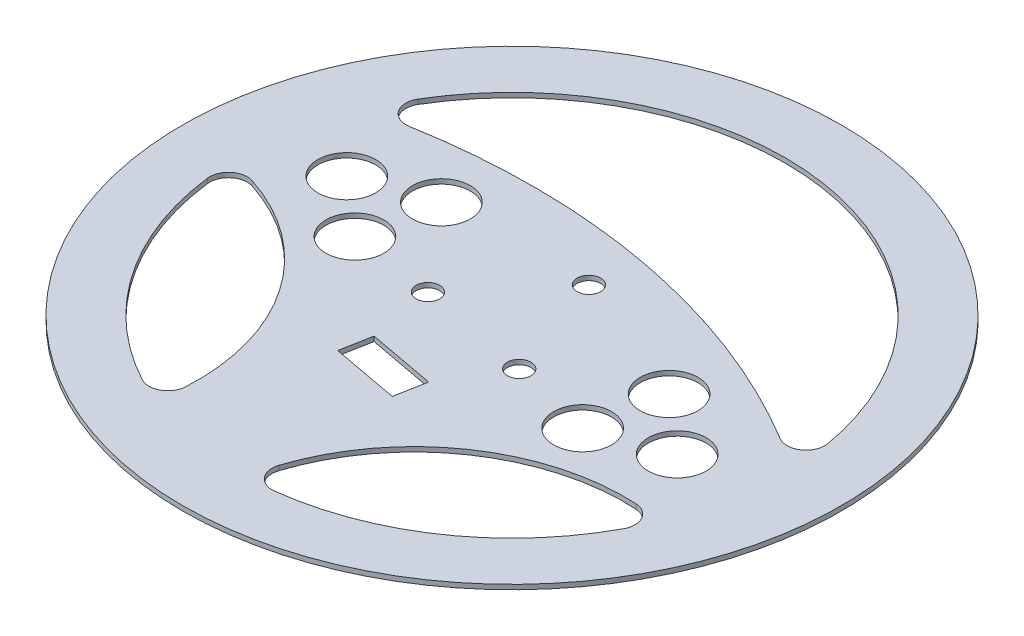
ISO-10303-21;
HEADER;
FILE_DESCRIPTION(('STEP AP214'),'2;1');
FILE_NAME('part.step','',(''),(''),'','','');
FILE_SCHEMA(('AUTOMOTIVE_DESIGN { 1 0 10303 214 1 1 1 1 }'));
ENDSEC;
DATA;
#1=APPLICATION_CONTEXT('core data for automotive mechanical design processes');
#2=APPLICATION_PROTOCOL_DEFINITION('international standard','automotive_design',2000,#1);
#3=PRODUCT_CONTEXT('',#1,'mechanical');
#4=PRODUCT('Part','Part','',(#3));
#5=PRODUCT_RELATED_PRODUCT_CATEGORY('part','',(#4));
#6=PRODUCT_DEFINITION_FORMATION('','',#4);
#7=PRODUCT_DEFINITION_CONTEXT('part definition',#1,'design');
#8=PRODUCT_DEFINITION('design','',#6,#7);
#9=PRODUCT_DEFINITION_SHAPE('','',#8);
#10=(LENGTH_UNIT() NAMED_UNIT(*) SI_UNIT(.MILLI.,.METRE.));
#11=(NAMED_UNIT(*) PLANE_ANGLE_UNIT() SI_UNIT($,.RADIAN.));
#12=(NAMED_UNIT(*) SI_UNIT($,.STERADIAN.) SOLID_ANGLE_UNIT());
#13=UNCERTAINTY_MEASURE_WITH_UNIT(LENGTH_MEASURE(1.E-05),#10,'distance_accuracy_value','');
#14=(GEOMETRIC_REPRESENTATION_CONTEXT(3) GLOBAL_UNCERTAINTY_ASSIGNED_CONTEXT((#13)) GLOBAL_UNIT_ASSIGNED_CONTEXT((#10,
#11,#12)) REPRESENTATION_CONTEXT('',''));
#15=CARTESIAN_POINT('',(0.,0.,0.));
#16=DIRECTION('',(0.,0.,1.));
#17=DIRECTION('',(1.,0.,0.));
#18=AXIS2_PLACEMENT_3D('',#15,#16,#17);
#19=CARTESIAN_POINT('',(0.,1.5875,-2.06711003662507));
#20=DIRECTION('',(0.,1.,0.));
#21=DIRECTION('',(0.,0.,1.));
#22=AXIS2_PLACEMENT_3D('',#19,#20,#21);
#23=PLANE('',#22);
#24=CARTESIAN_POINT('',(44.8976157062274,1.5875,19.0149701239264));
#25=DIRECTION('',(0.,1.,0.));
#26=DIRECTION('',(0.,0.,-1.));
#27=AXIS2_PLACEMENT_3D('',#24,#25,#26);
#28=CIRCLE('',#27,9.75);
#29=CARTESIAN_POINT('',(44.8976157062274,1.5875,9.2649701239264));
#30=VERTEX_POINT('',#29);
#31=EDGE_CURVE('E295',#30,#30,#28,.T.);
#32=ORIENTED_EDGE('',*,*,#31,.F.);
#33=EDGE_LOOP('',(#32));
#34=FACE_BOUND('',#33,.T.);
#35=CARTESIAN_POINT('',(16.8858438145613,1.5875,12.3834575532753));
#36=DIRECTION('',(0.,1.,0.));
#37=DIRECTION('',(0.,0.,1.));
#38=AXIS2_PLACEMENT_3D('',#35,#36,#37);
#39=CIRCLE('',#38,3.96875000000122);
#40=CARTESIAN_POINT('',(16.8858438145613,1.5875,16.3522075532765));
#41=VERTEX_POINT('',#40);
#42=EDGE_CURVE('E311',#41,#41,#39,.T.);
#43=ORIENTED_EDGE('',*,*,#42,.F.);
#44=EDGE_LOOP('',(#43));
#45=FACE_BOUND('',#44,.T.);
#46=CARTESIAN_POINT('',(-20.9574805392369,1.5875,5.33117587617061));
#47=DIRECTION('',(0.,1.,0.));
#48=DIRECTION('',(0.,0.,1.));
#49=AXIS2_PLACEMENT_3D('',#46,#47,#48);
#50=CIRCLE('',#49,3.9687500000018);
#51=CARTESIAN_POINT('',(-20.9574805392369,1.5875,9.29992587617241));
#52=VERTEX_POINT('',#51);
#53=EDGE_CURVE('E327',#52,#52,#50,.T.);
#54=ORIENTED_EDGE('',*,*,#53,.F.);
#55=EDGE_LOOP('',(#54));
#56=FACE_BOUND('',#55,.T.);
#57=CARTESIAN_POINT('',(-44.8976157062275,1.5875,-23.1491901971765));
#58=DIRECTION('',(0.,1.,0.));
#59=DIRECTION('',(0.,0.,1.));
#60=AXIS2_PLACEMENT_3D('',#57,#58,#59);
#61=CIRCLE('',#60,9.75);
#62=CARTESIAN_POINT('',(-44.8976157062275,1.5875,-13.3991901971765));
#63=VERTEX_POINT('',#62);
#64=EDGE_CURVE('E343',#63,#63,#61,.T.);
#65=ORIENTED_EDGE('',*,*,#64,.F.);
#66=EDGE_LOOP('',(#65));
#67=FACE_BOUND('',#66,.T.);
#68=DIRECTION('',(0.183200752516462,0.,-0.983075523180901));
#69=VECTOR('',#68,1.);
#70=CARTESIAN_POINT('',(3.51999002482874,1.5875,41.8169016517409));
#71=LINE('',#70,#69);
#72=CARTESIAN_POINT('',(3.51999002482874,1.5875,41.8169016517409));
#73=VERTEX_POINT('',#72);
#74=CARTESIAN_POINT('',(5.4435979262516,1.5875,31.4946086583415));
#75=VERTEX_POINT('',#74);
#76=EDGE_CURVE('E362',#73,#75,#71,.T.);
#77=ORIENTED_EDGE('',*,*,#76,.F.);
#78=DIRECTION('',(0.983075523180901,0.,0.183200752516463));
#79=VECTOR('',#78,1.);
#80=CARTESIAN_POINT('',(-19.090747008332,1.5875,37.6032843438623));
#81=LINE('',#80,#79);
#82=CARTESIAN_POINT('',(-19.090747008332,1.5875,37.6032843438623));
#83=VERTEX_POINT('',#82);
#84=EDGE_CURVE('E359',#83,#73,#81,.T.);
#85=ORIENTED_EDGE('',*,*,#84,.F.);
#86=DIRECTION('',(-0.183200752516463,0.,0.983075523180901));
#87=VECTOR('',#86,1.);
#88=CARTESIAN_POINT('',(-17.1671391069091,1.5875,27.2809913504628));
#89=LINE('',#88,#87);
#90=CARTESIAN_POINT('',(-17.1671391069091,1.5875,27.2809913504628));
#91=VERTEX_POINT('',#90);
#92=EDGE_CURVE('E370',#91,#83,#89,.T.);
#93=ORIENTED_EDGE('',*,*,#92,.F.);
#94=DIRECTION('',(-0.983075523180901,0.,-0.183200752516463));
#95=VECTOR('',#94,1.);
#96=CARTESIAN_POINT('',(5.4435979262516,1.5875,31.4946086583415));
#97=LINE('',#96,#95);
#98=EDGE_CURVE('E366',#75,#91,#97,.T.);
#99=ORIENTED_EDGE('',*,*,#98,.F.);
#100=EDGE_LOOP('',(#77,#85,#93,#99));
#101=FACE_BOUND('',#100,.T.);
#102=CARTESIAN_POINT('',(0.,1.5875,-2.06711003662507));
#103=DIRECTION('',(0.,1.,0.));
#104=DIRECTION('',(0.,0.,1.));
#105=AXIS2_PLACEMENT_3D('',#102,#103,#104);
#106=CIRCLE('',#105,111.125);
#107=CARTESIAN_POINT('',(0.,1.5875,109.057889963375));
#108=VERTEX_POINT('',#107);
#109=EDGE_CURVE('E11',#108,#108,#106,.T.);
#110=ORIENTED_EDGE('',*,*,#109,.T.);
#111=EDGE_LOOP('',(#110));
#112=FACE_BOUND('',#111,.T.);
#113=CARTESIAN_POINT('',(4.07163672467834,1.5875,-23.9159635393206));
#114=DIRECTION('',(0.,1.,0.));
#115=DIRECTION('',(0.,0.,1.));
#116=AXIS2_PLACEMENT_3D('',#113,#114,#115);
#117=CIRCLE('',#116,3.96875);
#118=CARTESIAN_POINT('',(4.07163672467834,1.5875,-19.9472135393206));
#119=VERTEX_POINT('',#118);
#120=EDGE_CURVE('E351',#119,#119,#117,.T.);
#121=ORIENTED_EDGE('',*,*,#120,.F.);
#122=EDGE_LOOP('',(#121));
#123=FACE_BOUND('',#122,.T.);
#124=CARTESIAN_POINT('',(-49.4776345191391,1.5875,1.42769788234599));
#125=DIRECTION('',(0.,1.,0.));
#126=DIRECTION('',(0.,0.,1.));
#127=AXIS2_PLACEMENT_3D('',#124,#125,#126);
#128=CIRCLE('',#127,9.75);
#129=CARTESIAN_POINT('',(-49.4776345191391,1.5875,11.177697882346));
#130=VERTEX_POINT('',#129);
#131=EDGE_CURVE('E335',#130,#130,#128,.T.);
#132=ORIENTED_EDGE('',*,*,#131,.F.);
#133=EDGE_LOOP('',(#132));
#134=FACE_BOUND('',#133,.T.);
#135=CARTESIAN_POINT('',(-68.4718345355167,1.5875,-14.8271587992073));
#136=DIRECTION('',(0.,1.,0.));
#137=DIRECTION('',(0.,0.,1.));
#138=AXIS2_PLACEMENT_3D('',#135,#136,#137);
#139=CIRCLE('',#138,9.75);
#140=CARTESIAN_POINT('',(-68.4718345355167,1.5875,-5.07715879920734));
#141=VERTEX_POINT('',#140);
#142=EDGE_CURVE('E319',#141,#141,#139,.T.);
#143=ORIENTED_EDGE('',*,*,#142,.F.);
#144=EDGE_LOOP('',(#143));
#145=FACE_BOUND('',#144,.T.);
#146=CARTESIAN_POINT('',(68.4718345355166,1.5875,10.6929387259572));
#147=DIRECTION('',(0.,1.,0.));
#148=DIRECTION('',(0.,0.,-1.));
#149=AXIS2_PLACEMENT_3D('',#146,#147,#148);
#150=CIRCLE('',#149,9.75);
#151=CARTESIAN_POINT('',(68.4718345355166,1.5875,0.942938725957191));
#152=VERTEX_POINT('',#151);
#153=EDGE_CURVE('E303',#152,#152,#150,.T.);
#154=ORIENTED_EDGE('',*,*,#153,.F.);
#155=EDGE_LOOP('',(#154));
#156=FACE_BOUND('',#155,.T.);
#157=CARTESIAN_POINT('',(49.477634519139,1.5875,-5.56191795559613));
#158=DIRECTION('',(0.,1.,0.));
#159=DIRECTION('',(0.,0.,-1.));
#160=AXIS2_PLACEMENT_3D('',#157,#158,#159);
#161=CIRCLE('',#160,9.75000000000001);
#162=CARTESIAN_POINT('',(49.477634519139,1.5875,-15.3119179555961));
#163=VERTEX_POINT('',#162);
#164=EDGE_CURVE('E287',#163,#163,#161,.T.);
#165=ORIENTED_EDGE('',*,*,#164,.F.);
#166=EDGE_LOOP('',(#165));
#167=FACE_BOUND('',#166,.T.);
#168=CARTESIAN_POINT('',(0.,1.5875,-2.06711003662507));
#169=DIRECTION('',(0.,1.,0.));
#170=DIRECTION('',(0.,0.,1.));
#171=AXIS2_PLACEMENT_3D('',#168,#169,#170);
#172=CIRCLE('',#171,92.0749999999999);
#173=CARTESIAN_POINT('',(90.7192403314717,1.5875,-17.8095704123306));
#174=VERTEX_POINT('',#173);
#175=CARTESIAN_POINT('',(-78.959268714598,1.5875,-49.4299594975253));
#176=VERTEX_POINT('',#175);
#177=EDGE_CURVE('E247',#174,#176,#172,.T.);
#178=ORIENTED_EDGE('',*,*,#177,.F.);
#179=CARTESIAN_POINT('',(84.4627409982668,1.5875,-16.7238834898681));
#180=DIRECTION('',(0.,1.,0.));
#181=DIRECTION('',(0.,0.,1.));
#182=AXIS2_PLACEMENT_3D('',#179,#180,#181);
#183=CIRCLE('',#182,6.35);
#184=CARTESIAN_POINT('',(81.1818818600487,1.5875,-11.2871139237406));
#185=VERTEX_POINT('',#184);
#186=EDGE_CURVE('E244',#185,#174,#183,.T.);
#187=ORIENTED_EDGE('',*,*,#186,.F.);
#188=CARTESIAN_POINT('',(-33.7848904416766,1.5875,179.22635295598));
#189=DIRECTION('',(0.,-1.,0.));
#190=DIRECTION('',(0.,0.,1.));
#191=AXIS2_PLACEMENT_3D('',#188,#189,#190);
#192=CIRCLE('',#191,222.514583333333);
#193=CARTESIAN_POINT('',(-72.4114968487057,1.5875,-39.909963234385));
#194=VERTEX_POINT('',#193);
#195=EDGE_CURVE('E255',#194,#185,#192,.T.);
#196=ORIENTED_EDGE('',*,*,#195,.F.);
#197=CARTESIAN_POINT('',(-73.5138019066947,1.5875,-46.1635560864288));
#198=DIRECTION('',(0.,1.,0.));
#199=DIRECTION('',(0.,0.,-1.));
#200=AXIS2_PLACEMENT_3D('',#197,#198,#199);
#201=CIRCLE('',#200,6.35);
#202=EDGE_CURVE('E251',#176,#194,#201,.T.);
#203=ORIENTED_EDGE('',*,*,#202,.F.);
#204=EDGE_LOOP('',(#178,#187,#196,#203));
#205=FACE_BOUND('',#204,.T.);
#206=CARTESIAN_POINT('',(72.0549246684685,1.5875,102.994272407265));
#207=DIRECTION('',(0.,1.,0.));
#208=DIRECTION('',(0.,0.,-1.));
#209=AXIS2_PLACEMENT_3D('',#206,#207,#208);
#210=CIRCLE('',#209,71.0327570903557);
#211=CARTESIAN_POINT('',(75.9135927443641,1.5875,32.0663987570736));
#212=VERTEX_POINT('',#211);
#213=CARTESIAN_POINT('',(4.49819317107478,1.5875,81.0456822646951));
#214=VERTEX_POINT('',#213);
#215=EDGE_CURVE('E204',#212,#214,#210,.T.);
#216=ORIENTED_EDGE('',*,*,#215,.F.);
#217=CARTESIAN_POINT('',(75.5686456624035,1.5875,38.4070226625459));
#218=DIRECTION('',(0.,1.,0.));
#219=DIRECTION('',(0.,0.,-1.));
#220=AXIS2_PLACEMENT_3D('',#217,#218,#219);
#221=CIRCLE('',#220,6.35);
#222=CARTESIAN_POINT('',(81.1663231188778,1.5875,41.4051065661882));
#223=VERTEX_POINT('',#222);
#224=EDGE_CURVE('E201',#223,#212,#221,.T.);
#225=ORIENTED_EDGE('',*,*,#224,.F.);
#226=CARTESIAN_POINT('',(0.,1.5875,-2.06711003662507));
#227=DIRECTION('',(0.,1.,0.));
#228=DIRECTION('',(0.,0.,1.));
#229=AXIS2_PLACEMENT_3D('',#226,#227,#228);
#230=CIRCLE('',#229,92.075);
#231=CARTESIAN_POINT('',(11.3180045989,1.5875,89.3096287807527));
#232=VERTEX_POINT('',#231);
#233=EDGE_CURVE('E212',#232,#223,#230,.T.);
#234=ORIENTED_EDGE('',*,*,#233,.F.);
#235=CARTESIAN_POINT('',(10.5374525575965,1.5875,83.0077847243819));
#236=DIRECTION('',(0.,1.,0.));
#237=DIRECTION('',(0.,0.,1.));
#238=AXIS2_PLACEMENT_3D('',#235,#236,#237);
#239=CIRCLE('',#238,6.35);
#240=EDGE_CURVE('E208',#214,#232,#239,.T.);
#241=ORIENTED_EDGE('',*,*,#240,.F.);
#242=EDGE_LOOP('',(#216,#225,#234,#241));
#243=FACE_BOUND('',#242,.T.);
#244=CARTESIAN_POINT('',(-105.06138244389,1.5875,69.9878146318434));
#245=DIRECTION('',(0.,1.,0.));
#246=DIRECTION('',(0.,0.,1.));
#247=AXIS2_PLACEMENT_3D('',#244,#245,#246);
#248=CIRCLE('',#247,71.0327570903556);
#249=CARTESIAN_POINT('',(-34.1335087936987,1.5875,73.8464827077392));
#250=VERTEX_POINT('',#249);
#251=CARTESIAN_POINT('',(-83.1127923013202,1.5875,2.43108313444973));
#252=VERTEX_POINT('',#251);
#253=EDGE_CURVE('E162',#250,#252,#248,.T.);
#254=ORIENTED_EDGE('',*,*,#253,.F.);
#255=CARTESIAN_POINT('',(-40.474132699171,1.5875,73.5015356257785));
#256=DIRECTION('',(0.,1.,0.));
#257=DIRECTION('',(0.,0.,-1.));
#258=AXIS2_PLACEMENT_3D('',#255,#256,#257);
#259=CIRCLE('',#258,6.35);
#260=CARTESIAN_POINT('',(-43.4722166028134,1.5875,79.0992130822528));
#261=VERTEX_POINT('',#260);
#262=EDGE_CURVE('E153',#261,#250,#259,.T.);
#263=ORIENTED_EDGE('',*,*,#262,.F.);
#264=CARTESIAN_POINT('',(0.,1.5875,-2.06711003662507));
#265=DIRECTION('',(0.,1.,0.));
#266=DIRECTION('',(0.,0.,1.));
#267=AXIS2_PLACEMENT_3D('',#264,#265,#266);
#268=CIRCLE('',#267,92.075);
#269=CARTESIAN_POINT('',(-91.3767388173779,1.5875,9.25089456227493));
#270=VERTEX_POINT('',#269);
#271=EDGE_CURVE('E179',#270,#261,#268,.T.);
#272=ORIENTED_EDGE('',*,*,#271,.F.);
#273=CARTESIAN_POINT('',(-85.074894761007,1.5875,8.47034252097148));
#274=DIRECTION('',(0.,1.,0.));
#275=DIRECTION('',(0.,0.,1.));
#276=AXIS2_PLACEMENT_3D('',#273,#274,#275);
#277=CIRCLE('',#276,6.35);
#278=EDGE_CURVE('E175',#252,#270,#277,.T.);
#279=ORIENTED_EDGE('',*,*,#278,.F.);
#280=EDGE_LOOP('',(#254,#263,#272,#279));
#281=FACE_BOUND('',#280,.T.);
#282=ADVANCED_FACE('F39',(#34,#45,#56,#67,#101,#112,#123,#134,#145,#156,#167,#205,#243,#281),
#23,.T.);
#283=CARTESIAN_POINT('',(0.,0.,-2.06711003662507));
#284=DIRECTION('',(0.,1.,0.));
#285=DIRECTION('',(0.,0.,1.));
#286=AXIS2_PLACEMENT_3D('',#283,#284,#285);
#287=PLANE('',#286);
#288=CARTESIAN_POINT('',(75.5686456624035,0.,38.4070226625459));
#289=DIRECTION('',(0.,1.,0.));
#290=DIRECTION('',(0.,0.,-1.));
#291=AXIS2_PLACEMENT_3D('',#288,#289,#290);
#292=CIRCLE('',#291,6.35);
#293=CARTESIAN_POINT('',(81.1663231188778,0.,41.4051065661882));
#294=VERTEX_POINT('',#293);
#295=CARTESIAN_POINT('',(75.9135927443641,0.,32.0663987570736));
#296=VERTEX_POINT('',#295);
#297=EDGE_CURVE('E171',#294,#296,#292,.T.);
#298=ORIENTED_EDGE('',*,*,#297,.T.);
#299=CARTESIAN_POINT('',(72.0549246684685,0.,102.994272407265));
#300=DIRECTION('',(0.,1.,0.));
#301=DIRECTION('',(0.,0.,-1.));
#302=AXIS2_PLACEMENT_3D('',#299,#300,#301);
#303=CIRCLE('',#302,71.0327570903557);
#304=CARTESIAN_POINT('',(4.49819317107478,0.,81.0456822646951));
#305=VERTEX_POINT('',#304);
#306=EDGE_CURVE('E219',#296,#305,#303,.T.);
#307=ORIENTED_EDGE('',*,*,#306,.T.);
#308=CARTESIAN_POINT('',(10.5374525575965,0.,83.0077847243819));
#309=DIRECTION('',(0.,1.,0.));
#310=DIRECTION('',(0.,0.,1.));
#311=AXIS2_PLACEMENT_3D('',#308,#309,#310);
#312=CIRCLE('',#311,6.35);
#313=CARTESIAN_POINT('',(11.3180045989,0.,89.3096287807527));
#314=VERTEX_POINT('',#313);
#315=EDGE_CURVE('E223',#305,#314,#312,.T.);
#316=ORIENTED_EDGE('',*,*,#315,.T.);
#317=CARTESIAN_POINT('',(0.,0.,-2.06711003662507));
#318=DIRECTION('',(0.,1.,0.));
#319=DIRECTION('',(0.,0.,1.));
#320=AXIS2_PLACEMENT_3D('',#317,#318,#319);
#321=CIRCLE('',#320,92.075);
#322=EDGE_CURVE('E205',#314,#294,#321,.T.);
#323=ORIENTED_EDGE('',*,*,#322,.T.);
#324=EDGE_LOOP('',(#298,#307,#316,#323));
#325=FACE_BOUND('',#324,.T.);
#326=CARTESIAN_POINT('',(49.477634519139,0.,-5.56191795559613));
#327=DIRECTION('',(0.,1.,0.));
#328=DIRECTION('',(0.,0.,-1.));
#329=AXIS2_PLACEMENT_3D('',#326,#327,#328);
#330=CIRCLE('',#329,9.75000000000001);
#331=CARTESIAN_POINT('',(49.477634519139,0.,-15.3119179555961));
#332=VERTEX_POINT('',#331);
#333=EDGE_CURVE('E286',#332,#332,#330,.T.);
#334=ORIENTED_EDGE('',*,*,#333,.T.);
#335=EDGE_LOOP('',(#334));
#336=FACE_BOUND('',#335,.T.);
#337=CARTESIAN_POINT('',(44.8976157062274,0.,19.0149701239264));
#338=DIRECTION('',(0.,1.,0.));
#339=DIRECTION('',(0.,0.,-1.));
#340=AXIS2_PLACEMENT_3D('',#337,#338,#339);
#341=CIRCLE('',#340,9.75);
#342=CARTESIAN_POINT('',(44.8976157062274,0.,9.2649701239264));
#343=VERTEX_POINT('',#342);
#344=EDGE_CURVE('E291',#343,#343,#341,.T.);
#345=ORIENTED_EDGE('',*,*,#344,.T.);
#346=EDGE_LOOP('',(#345));
#347=FACE_BOUND('',#346,.T.);
#348=CARTESIAN_POINT('',(68.4718345355166,0.,10.6929387259572));
#349=DIRECTION('',(0.,1.,0.));
#350=DIRECTION('',(0.,0.,-1.));
#351=AXIS2_PLACEMENT_3D('',#348,#349,#350);
#352=CIRCLE('',#351,9.75);
#353=CARTESIAN_POINT('',(68.4718345355166,0.,0.942938725957191));
#354=VERTEX_POINT('',#353);
#355=EDGE_CURVE('E299',#354,#354,#352,.T.);
#356=ORIENTED_EDGE('',*,*,#355,.T.);
#357=EDGE_LOOP('',(#356));
#358=FACE_BOUND('',#357,.T.);
#359=CARTESIAN_POINT('',(16.8858438145613,0.,12.3834575532753));
#360=DIRECTION('',(0.,1.,0.));
#361=DIRECTION('',(0.,0.,1.));
#362=AXIS2_PLACEMENT_3D('',#359,#360,#361);
#363=CIRCLE('',#362,3.96875000000122);
#364=CARTESIAN_POINT('',(16.8858438145613,0.,16.3522075532765));
#365=VERTEX_POINT('',#364);
#366=EDGE_CURVE('E307',#365,#365,#363,.T.);
#367=ORIENTED_EDGE('',*,*,#366,.T.);
#368=EDGE_LOOP('',(#367));
#369=FACE_BOUND('',#368,.T.);
#370=CARTESIAN_POINT('',(-68.4718345355167,0.,-14.8271587992073));
#371=DIRECTION('',(0.,1.,0.));
#372=DIRECTION('',(0.,0.,1.));
#373=AXIS2_PLACEMENT_3D('',#370,#371,#372);
#374=CIRCLE('',#373,9.75);
#375=CARTESIAN_POINT('',(-68.4718345355167,0.,-5.07715879920734));
#376=VERTEX_POINT('',#375);
#377=EDGE_CURVE('E315',#376,#376,#374,.T.);
#378=ORIENTED_EDGE('',*,*,#377,.T.);
#379=EDGE_LOOP('',(#378));
#380=FACE_BOUND('',#379,.T.);
#381=CARTESIAN_POINT('',(-20.9574805392369,0.,5.33117587617061));
#382=DIRECTION('',(0.,1.,0.));
#383=DIRECTION('',(0.,0.,1.));
#384=AXIS2_PLACEMENT_3D('',#381,#382,#383);
#385=CIRCLE('',#384,3.9687500000018);
#386=CARTESIAN_POINT('',(-20.9574805392369,0.,9.29992587617241));
#387=VERTEX_POINT('',#386);
#388=EDGE_CURVE('E323',#387,#387,#385,.T.);
#389=ORIENTED_EDGE('',*,*,#388,.T.);
#390=EDGE_LOOP('',(#389));
#391=FACE_BOUND('',#390,.T.);
#392=CARTESIAN_POINT('',(-49.4776345191391,0.,1.42769788234599));
#393=DIRECTION('',(0.,1.,0.));
#394=DIRECTION('',(0.,0.,1.));
#395=AXIS2_PLACEMENT_3D('',#392,#393,#394);
#396=CIRCLE('',#395,9.75);
#397=CARTESIAN_POINT('',(-49.4776345191391,0.,11.177697882346));
#398=VERTEX_POINT('',#397);
#399=EDGE_CURVE('E331',#398,#398,#396,.T.);
#400=ORIENTED_EDGE('',*,*,#399,.T.);
#401=EDGE_LOOP('',(#400));
#402=FACE_BOUND('',#401,.T.);
#403=CARTESIAN_POINT('',(-44.8976157062275,0.,-23.1491901971765));
#404=DIRECTION('',(0.,1.,0.));
#405=DIRECTION('',(0.,0.,1.));
#406=AXIS2_PLACEMENT_3D('',#403,#404,#405);
#407=CIRCLE('',#406,9.75);
#408=CARTESIAN_POINT('',(-44.8976157062275,0.,-13.3991901971765));
#409=VERTEX_POINT('',#408);
#410=EDGE_CURVE('E339',#409,#409,#407,.T.);
#411=ORIENTED_EDGE('',*,*,#410,.T.);
#412=EDGE_LOOP('',(#411));
#413=FACE_BOUND('',#412,.T.);
#414=CARTESIAN_POINT('',(4.07163672467834,0.,-23.9159635393206));
#415=DIRECTION('',(0.,1.,0.));
#416=DIRECTION('',(0.,0.,1.));
#417=AXIS2_PLACEMENT_3D('',#414,#415,#416);
#418=CIRCLE('',#417,3.96875);
#419=CARTESIAN_POINT('',(4.07163672467834,0.,-19.9472135393206));
#420=VERTEX_POINT('',#419);
#421=EDGE_CURVE('E347',#420,#420,#418,.T.);
#422=ORIENTED_EDGE('',*,*,#421,.T.);
#423=EDGE_LOOP('',(#422));
#424=FACE_BOUND('',#423,.T.);
#425=DIRECTION('',(0.983075523180901,0.,0.183200752516463));
#426=VECTOR('',#425,1.);
#427=CARTESIAN_POINT('',(-19.090747008332,0.,37.6032843438623));
#428=LINE('',#427,#426);
#429=CARTESIAN_POINT('',(-19.090747008332,0.,37.6032843438623));
#430=VERTEX_POINT('',#429);
#431=CARTESIAN_POINT('',(3.51999002482874,0.,41.8169016517409));
#432=VERTEX_POINT('',#431);
#433=EDGE_CURVE('E355',#430,#432,#428,.T.);
#434=ORIENTED_EDGE('',*,*,#433,.T.);
#435=DIRECTION('',(0.183200752516462,0.,-0.983075523180901));
#436=VECTOR('',#435,1.);
#437=CARTESIAN_POINT('',(3.51999002482874,0.,41.8169016517409));
#438=LINE('',#437,#436);
#439=CARTESIAN_POINT('',(5.4435979262516,0.,31.4946086583415));
#440=VERTEX_POINT('',#439);
#441=EDGE_CURVE('E377',#432,#440,#438,.T.);
#442=ORIENTED_EDGE('',*,*,#441,.T.);
#443=DIRECTION('',(-0.983075523180901,0.,-0.183200752516463));
#444=VECTOR('',#443,1.);
#445=CARTESIAN_POINT('',(5.4435979262516,0.,31.4946086583415));
#446=LINE('',#445,#444);
#447=CARTESIAN_POINT('',(-17.1671391069091,0.,27.2809913504628));
#448=VERTEX_POINT('',#447);
#449=EDGE_CURVE('E381',#440,#448,#446,.T.);
#450=ORIENTED_EDGE('',*,*,#449,.T.);
#451=DIRECTION('',(-0.183200752516463,0.,0.983075523180901));
#452=VECTOR('',#451,1.);
#453=CARTESIAN_POINT('',(-17.1671391069091,0.,27.2809913504628));
#454=LINE('',#453,#452);
#455=EDGE_CURVE('E363',#448,#430,#454,.T.);
#456=ORIENTED_EDGE('',*,*,#455,.T.);
#457=EDGE_LOOP('',(#434,#442,#450,#456));
#458=FACE_BOUND('',#457,.T.);
#459=CARTESIAN_POINT('',(0.,0.,-2.06711003662507));
#460=DIRECTION('',(0.,1.,0.));
#461=DIRECTION('',(0.,0.,1.));
#462=AXIS2_PLACEMENT_3D('',#459,#460,#461);
#463=CIRCLE('',#462,111.125);
#464=CARTESIAN_POINT('',(0.,0.,109.057889963375));
#465=VERTEX_POINT('',#464);
#466=EDGE_CURVE('E43',#465,#465,#463,.T.);
#467=ORIENTED_EDGE('',*,*,#466,.F.);
#468=EDGE_LOOP('',(#467));
#469=FACE_BOUND('',#468,.T.);
#470=CARTESIAN_POINT('',(84.4627409982668,0.,-16.7238834898681));
#471=DIRECTION('',(0.,1.,0.));
#472=DIRECTION('',(0.,0.,1.));
#473=AXIS2_PLACEMENT_3D('',#470,#471,#472);
#474=CIRCLE('',#473,6.35);
#475=CARTESIAN_POINT('',(81.1818818600487,0.,-11.2871139237406));
#476=VERTEX_POINT('',#475);
#477=CARTESIAN_POINT('',(90.7192403314717,0.,-17.8095704123306));
#478=VERTEX_POINT('',#477);
#479=EDGE_CURVE('E243',#476,#478,#474,.T.);
#480=ORIENTED_EDGE('',*,*,#479,.T.);
#481=CARTESIAN_POINT('',(0.,0.,-2.06711003662507));
#482=DIRECTION('',(0.,1.,0.));
#483=DIRECTION('',(0.,0.,1.));
#484=AXIS2_PLACEMENT_3D('',#481,#482,#483);
#485=CIRCLE('',#484,92.0749999999999);
#486=CARTESIAN_POINT('',(-78.959268714598,0.,-49.4299594975253));
#487=VERTEX_POINT('',#486);
#488=EDGE_CURVE('E262',#478,#487,#485,.T.);
#489=ORIENTED_EDGE('',*,*,#488,.T.);
#490=CARTESIAN_POINT('',(-73.5138019066947,0.,-46.1635560864288));
#491=DIRECTION('',(0.,1.,0.));
#492=DIRECTION('',(0.,0.,-1.));
#493=AXIS2_PLACEMENT_3D('',#490,#491,#492);
#494=CIRCLE('',#493,6.35);
#495=CARTESIAN_POINT('',(-72.4114968487057,0.,-39.909963234385));
#496=VERTEX_POINT('',#495);
#497=EDGE_CURVE('E266',#487,#496,#494,.T.);
#498=ORIENTED_EDGE('',*,*,#497,.T.);
#499=CARTESIAN_POINT('',(-33.7848904416766,0.,179.22635295598));
#500=DIRECTION('',(0.,-1.,0.));
#501=DIRECTION('',(0.,0.,1.));
#502=AXIS2_PLACEMENT_3D('',#499,#500,#501);
#503=CIRCLE('',#502,222.514583333333);
#504=EDGE_CURVE('E248',#496,#476,#503,.T.);
#505=ORIENTED_EDGE('',*,*,#504,.T.);
#506=EDGE_LOOP('',(#480,#489,#498,#505));
#507=FACE_BOUND('',#506,.T.);
#508=CARTESIAN_POINT('',(-40.474132699171,0.,73.5015356257785));
#509=DIRECTION('',(0.,1.,0.));
#510=DIRECTION('',(0.,0.,-1.));
#511=AXIS2_PLACEMENT_3D('',#508,#509,#510);
#512=CIRCLE('',#511,6.35);
#513=CARTESIAN_POINT('',(-43.4722166028134,0.,79.0992130822528));
#514=VERTEX_POINT('',#513);
#515=CARTESIAN_POINT('',(-34.1335087936987,0.,73.8464827077392));
#516=VERTEX_POINT('',#515);
#517=EDGE_CURVE('E63',#514,#516,#512,.T.);
#518=ORIENTED_EDGE('',*,*,#517,.T.);
#519=CARTESIAN_POINT('',(-105.06138244389,0.,69.9878146318434));
#520=DIRECTION('',(0.,1.,0.));
#521=DIRECTION('',(0.,0.,1.));
#522=AXIS2_PLACEMENT_3D('',#519,#520,#521);
#523=CIRCLE('',#522,71.0327570903556);
#524=CARTESIAN_POINT('',(-83.1127923013202,0.,2.43108313444973));
#525=VERTEX_POINT('',#524);
#526=EDGE_CURVE('E169',#516,#525,#523,.T.);
#527=ORIENTED_EDGE('',*,*,#526,.T.);
#528=CARTESIAN_POINT('',(-85.074894761007,0.,8.47034252097148));
#529=DIRECTION('',(0.,1.,0.));
#530=DIRECTION('',(0.,0.,1.));
#531=AXIS2_PLACEMENT_3D('',#528,#529,#530);
#532=CIRCLE('',#531,6.35);
#533=CARTESIAN_POINT('',(-91.3767388173779,0.,9.25089456227493));
#534=VERTEX_POINT('',#533);
#535=EDGE_CURVE('E188',#525,#534,#532,.T.);
#536=ORIENTED_EDGE('',*,*,#535,.T.);
#537=CARTESIAN_POINT('',(0.,0.,-2.06711003662507));
#538=DIRECTION('',(0.,1.,0.));
#539=DIRECTION('',(0.,0.,1.));
#540=AXIS2_PLACEMENT_3D('',#537,#538,#539);
#541=CIRCLE('',#540,92.075);
#542=EDGE_CURVE('E163',#534,#514,#541,.T.);
#543=ORIENTED_EDGE('',*,*,#542,.T.);
#544=EDGE_LOOP('',(#518,#527,#536,#543));
#545=FACE_BOUND('',#544,.T.);
#546=ADVANCED_FACE('F407',(#325,#336,#347,#358,#369,#380,#391,#402,#413,#424,#458,#469,#507,
#545),#287,.F.);
#547=CARTESIAN_POINT('',(0.,1.5875,-2.06711003662507));
#548=DIRECTION('',(0.,-1.,0.));
#549=DIRECTION('',(0.,0.,-1.));
#550=AXIS2_PLACEMENT_3D('',#547,#548,#549);
#551=CYLINDRICAL_SURFACE('',#550,111.125);
#552=ORIENTED_EDGE('',*,*,#109,.F.);
#553=EDGE_LOOP('',(#552));
#554=FACE_BOUND('',#553,.T.);
#555=ORIENTED_EDGE('',*,*,#466,.T.);
#556=EDGE_LOOP('',(#555));
#557=FACE_BOUND('',#556,.T.);
#558=ADVANCED_FACE('F41',(#554,#557),#551,.T.);
#559=CARTESIAN_POINT('',(-19.090747008332,1.5875,37.6032843438623));
#560=DIRECTION('',(0.183200752516463,0.,-0.983075523180901));
#561=DIRECTION('',(-0.983075523180901,0.,-0.183200752516463));
#562=AXIS2_PLACEMENT_3D('',#559,#560,#561);
#563=PLANE('',#562);
#564=ORIENTED_EDGE('',*,*,#433,.F.);
#565=DIRECTION('',(0.,-1.,0.));
#566=VECTOR('',#565,1.);
#567=CARTESIAN_POINT('',(-19.090747008332,1.5875,37.6032843438623));
#568=LINE('',#567,#566);
#569=EDGE_CURVE('E373',#83,#430,#568,.T.);
#570=ORIENTED_EDGE('',*,*,#569,.F.);
#571=ORIENTED_EDGE('',*,*,#84,.T.);
#572=DIRECTION('',(0.,-1.,0.));
#573=VECTOR('',#572,1.);
#574=CARTESIAN_POINT('',(3.51999002482874,1.5875,41.8169016517409));
#575=LINE('',#574,#573);
#576=EDGE_CURVE('E397',#73,#432,#575,.T.);
#577=ORIENTED_EDGE('',*,*,#576,.T.);
#578=EDGE_LOOP('',(#564,#570,#571,#577));
#579=FACE_BOUND('',#578,.T.);
#580=ADVANCED_FACE('F430',(#579),#563,.T.);
#581=CARTESIAN_POINT('',(3.51999002482874,1.5875,41.8169016517409));
#582=DIRECTION('',(-0.983075523180901,0.,-0.183200752516462));
#583=DIRECTION('',(-0.183200752516462,0.,0.983075523180901));
#584=AXIS2_PLACEMENT_3D('',#581,#582,#583);
#585=PLANE('',#584);
#586=ORIENTED_EDGE('',*,*,#441,.F.);
#587=ORIENTED_EDGE('',*,*,#576,.F.);
#588=ORIENTED_EDGE('',*,*,#76,.T.);
#589=DIRECTION('',(0.,-1.,0.));
#590=VECTOR('',#589,1.);
#591=CARTESIAN_POINT('',(5.4435979262516,1.5875,31.4946086583415));
#592=LINE('',#591,#590);
#593=EDGE_CURVE('E394',#75,#440,#592,.T.);
#594=ORIENTED_EDGE('',*,*,#593,.T.);
#595=EDGE_LOOP('',(#586,#587,#588,#594));
#596=FACE_BOUND('',#595,.T.);
#597=ADVANCED_FACE('F433',(#596),#585,.T.);
#598=CARTESIAN_POINT('',(5.4435979262516,1.5875,31.4946086583415));
#599=DIRECTION('',(-0.183200752516463,0.,0.983075523180901));
#600=DIRECTION('',(0.983075523180901,0.,0.183200752516463));
#601=AXIS2_PLACEMENT_3D('',#598,#599,#600);
#602=PLANE('',#601);
#603=ORIENTED_EDGE('',*,*,#449,.F.);
#604=ORIENTED_EDGE('',*,*,#593,.F.);
#605=ORIENTED_EDGE('',*,*,#98,.T.);
#606=DIRECTION('',(0.,-1.,0.));
#607=VECTOR('',#606,1.);
#608=CARTESIAN_POINT('',(-17.1671391069091,1.5875,27.2809913504628));
#609=LINE('',#608,#607);
#610=EDGE_CURVE('E391',#91,#448,#609,.T.);
#611=ORIENTED_EDGE('',*,*,#610,.T.);
#612=EDGE_LOOP('',(#603,#604,#605,#611));
#613=FACE_BOUND('',#612,.T.);
#614=ADVANCED_FACE('F436',(#613),#602,.T.);
#615=CARTESIAN_POINT('',(-17.1671391069091,1.5875,27.2809913504628));
#616=DIRECTION('',(0.983075523180901,0.,0.183200752516462));
#617=DIRECTION('',(0.183200752516463,0.,-0.983075523180901));
#618=AXIS2_PLACEMENT_3D('',#615,#616,#617);
#619=PLANE('',#618);
#620=ORIENTED_EDGE('',*,*,#455,.F.);
#621=ORIENTED_EDGE('',*,*,#610,.F.);
#622=ORIENTED_EDGE('',*,*,#92,.T.);
#623=ORIENTED_EDGE('',*,*,#569,.T.);
#624=EDGE_LOOP('',(#620,#621,#622,#623));
#625=FACE_BOUND('',#624,.T.);
#626=ADVANCED_FACE('F440',(#625),#619,.T.);
#627=CARTESIAN_POINT('',(4.07163672467834,1.5875,-23.9159635393206));
#628=DIRECTION('',(0.,-1.,0.));
#629=DIRECTION('',(0.,0.,-1.));
#630=AXIS2_PLACEMENT_3D('',#627,#628,#629);
#631=CYLINDRICAL_SURFACE('',#630,3.96875);
#632=ORIENTED_EDGE('',*,*,#120,.T.);
#633=EDGE_LOOP('',(#632));
#634=FACE_BOUND('',#633,.T.);
#635=ORIENTED_EDGE('',*,*,#421,.F.);
#636=EDGE_LOOP('',(#635));
#637=FACE_BOUND('',#636,.T.);
#638=ADVANCED_FACE('F444',(#634,#637),#631,.F.);
#639=CARTESIAN_POINT('',(-44.8976157062275,1.5875,-23.1491901971765));
#640=DIRECTION('',(0.,-1.,0.));
#641=DIRECTION('',(0.,0.,-1.));
#642=AXIS2_PLACEMENT_3D('',#639,#640,#641);
#643=CYLINDRICAL_SURFACE('',#642,9.75);
#644=ORIENTED_EDGE('',*,*,#64,.T.);
#645=EDGE_LOOP('',(#644));
#646=FACE_BOUND('',#645,.T.);
#647=ORIENTED_EDGE('',*,*,#410,.F.);
#648=EDGE_LOOP('',(#647));
#649=FACE_BOUND('',#648,.T.);
#650=ADVANCED_FACE('F448',(#646,#649),#643,.F.);
#651=CARTESIAN_POINT('',(-49.4776345191391,1.5875,1.42769788234599));
#652=DIRECTION('',(0.,-1.,0.));
#653=DIRECTION('',(0.,0.,-1.));
#654=AXIS2_PLACEMENT_3D('',#651,#652,#653);
#655=CYLINDRICAL_SURFACE('',#654,9.75);
#656=ORIENTED_EDGE('',*,*,#131,.T.);
#657=EDGE_LOOP('',(#656));
#658=FACE_BOUND('',#657,.T.);
#659=ORIENTED_EDGE('',*,*,#399,.F.);
#660=EDGE_LOOP('',(#659));
#661=FACE_BOUND('',#660,.T.);
#662=ADVANCED_FACE('F452',(#658,#661),#655,.F.);
#663=CARTESIAN_POINT('',(-20.9574805392369,1.5875,5.33117587617061));
#664=DIRECTION('',(0.,-1.,0.));
#665=DIRECTION('',(0.,0.,-1.));
#666=AXIS2_PLACEMENT_3D('',#663,#664,#665);
#667=CYLINDRICAL_SURFACE('',#666,3.9687500000018);
#668=ORIENTED_EDGE('',*,*,#53,.T.);
#669=EDGE_LOOP('',(#668));
#670=FACE_BOUND('',#669,.T.);
#671=ORIENTED_EDGE('',*,*,#388,.F.);
#672=EDGE_LOOP('',(#671));
#673=FACE_BOUND('',#672,.T.);
#674=ADVANCED_FACE('F456',(#670,#673),#667,.F.);
#675=CARTESIAN_POINT('',(-68.4718345355167,1.5875,-14.8271587992073));
#676=DIRECTION('',(0.,-1.,0.));
#677=DIRECTION('',(0.,0.,-1.));
#678=AXIS2_PLACEMENT_3D('',#675,#676,#677);
#679=CYLINDRICAL_SURFACE('',#678,9.75);
#680=ORIENTED_EDGE('',*,*,#142,.T.);
#681=EDGE_LOOP('',(#680));
#682=FACE_BOUND('',#681,.T.);
#683=ORIENTED_EDGE('',*,*,#377,.F.);
#684=EDGE_LOOP('',(#683));
#685=FACE_BOUND('',#684,.T.);
#686=ADVANCED_FACE('F460',(#682,#685),#679,.F.);
#687=CARTESIAN_POINT('',(16.8858438145613,1.5875,12.3834575532753));
#688=DIRECTION('',(0.,-1.,0.));
#689=DIRECTION('',(0.,0.,-1.));
#690=AXIS2_PLACEMENT_3D('',#687,#688,#689);
#691=CYLINDRICAL_SURFACE('',#690,3.96875000000122);
#692=ORIENTED_EDGE('',*,*,#42,.T.);
#693=EDGE_LOOP('',(#692));
#694=FACE_BOUND('',#693,.T.);
#695=ORIENTED_EDGE('',*,*,#366,.F.);
#696=EDGE_LOOP('',(#695));
#697=FACE_BOUND('',#696,.T.);
#698=ADVANCED_FACE('F464',(#694,#697),#691,.F.);
#699=CARTESIAN_POINT('',(68.4718345355166,1.5875,10.6929387259572));
#700=DIRECTION('',(0.,-1.,0.));
#701=DIRECTION('',(0.,0.,-1.));
#702=AXIS2_PLACEMENT_3D('',#699,#700,#701);
#703=CYLINDRICAL_SURFACE('',#702,9.75);
#704=ORIENTED_EDGE('',*,*,#153,.T.);
#705=EDGE_LOOP('',(#704));
#706=FACE_BOUND('',#705,.T.);
#707=ORIENTED_EDGE('',*,*,#355,.F.);
#708=EDGE_LOOP('',(#707));
#709=FACE_BOUND('',#708,.T.);
#710=ADVANCED_FACE('F468',(#706,#709),#703,.F.);
#711=CARTESIAN_POINT('',(44.8976157062274,1.5875,19.0149701239264));
#712=DIRECTION('',(0.,-1.,0.));
#713=DIRECTION('',(0.,0.,-1.));
#714=AXIS2_PLACEMENT_3D('',#711,#712,#713);
#715=CYLINDRICAL_SURFACE('',#714,9.75);
#716=ORIENTED_EDGE('',*,*,#31,.T.);
#717=EDGE_LOOP('',(#716));
#718=FACE_BOUND('',#717,.T.);
#719=ORIENTED_EDGE('',*,*,#344,.F.);
#720=EDGE_LOOP('',(#719));
#721=FACE_BOUND('',#720,.T.);
#722=ADVANCED_FACE('F472',(#718,#721),#715,.F.);
#723=CARTESIAN_POINT('',(49.477634519139,1.5875,-5.56191795559613));
#724=DIRECTION('',(0.,-1.,0.));
#725=DIRECTION('',(0.,0.,-1.));
#726=AXIS2_PLACEMENT_3D('',#723,#724,#725);
#727=CYLINDRICAL_SURFACE('',#726,9.75000000000001);
#728=ORIENTED_EDGE('',*,*,#164,.T.);
#729=EDGE_LOOP('',(#728));
#730=FACE_BOUND('',#729,.T.);
#731=ORIENTED_EDGE('',*,*,#333,.F.);
#732=EDGE_LOOP('',(#731));
#733=FACE_BOUND('',#732,.T.);
#734=ADVANCED_FACE('F476',(#730,#733),#727,.F.);
#735=CARTESIAN_POINT('',(84.4627409982668,1.5875,-16.7238834898681));
#736=DIRECTION('',(0.,-1.,0.));
#737=DIRECTION('',(0.,0.,-1.));
#738=AXIS2_PLACEMENT_3D('',#735,#736,#737);
#739=CYLINDRICAL_SURFACE('',#738,6.35);
#740=ORIENTED_EDGE('',*,*,#479,.F.);
#741=DIRECTION('',(0.,-1.,0.));
#742=VECTOR('',#741,1.);
#743=CARTESIAN_POINT('',(81.1818818600487,1.5875,-11.2871139237406));
#744=LINE('',#743,#742);
#745=EDGE_CURVE('E258',#185,#476,#744,.T.);
#746=ORIENTED_EDGE('',*,*,#745,.F.);
#747=ORIENTED_EDGE('',*,*,#186,.T.);
#748=DIRECTION('',(0.,-1.,0.));
#749=VECTOR('',#748,1.);
#750=CARTESIAN_POINT('',(90.7192403314717,1.5875,-17.8095704123306));
#751=LINE('',#750,#749);
#752=EDGE_CURVE('E282',#174,#478,#751,.T.);
#753=ORIENTED_EDGE('',*,*,#752,.T.);
#754=EDGE_LOOP('',(#740,#746,#747,#753));
#755=FACE_BOUND('',#754,.T.);
#756=ADVANCED_FACE('F480',(#755),#739,.F.);
#757=CARTESIAN_POINT('',(0.,1.5875,-2.06711003662507));
#758=DIRECTION('',(0.,-1.,0.));
#759=DIRECTION('',(0.,0.,-1.));
#760=AXIS2_PLACEMENT_3D('',#757,#758,#759);
#761=CYLINDRICAL_SURFACE('',#760,92.0749999999999);
#762=ORIENTED_EDGE('',*,*,#488,.F.);
#763=ORIENTED_EDGE('',*,*,#752,.F.);
#764=ORIENTED_EDGE('',*,*,#177,.T.);
#765=DIRECTION('',(0.,-1.,0.));
#766=VECTOR('',#765,1.);
#767=CARTESIAN_POINT('',(-78.959268714598,1.5875,-49.4299594975253));
#768=LINE('',#767,#766);
#769=EDGE_CURVE('E279',#176,#487,#768,.T.);
#770=ORIENTED_EDGE('',*,*,#769,.T.);
#771=EDGE_LOOP('',(#762,#763,#764,#770));
#772=FACE_BOUND('',#771,.T.);
#773=ADVANCED_FACE('F484',(#772),#761,.F.);
#774=CARTESIAN_POINT('',(-73.5138019066947,1.5875,-46.1635560864288));
#775=DIRECTION('',(0.,-1.,0.));
#776=DIRECTION('',(0.,0.,-1.));
#777=AXIS2_PLACEMENT_3D('',#774,#775,#776);
#778=CYLINDRICAL_SURFACE('',#777,6.35);
#779=ORIENTED_EDGE('',*,*,#497,.F.);
#780=ORIENTED_EDGE('',*,*,#769,.F.);
#781=ORIENTED_EDGE('',*,*,#202,.T.);
#782=DIRECTION('',(0.,-1.,0.));
#783=VECTOR('',#782,1.);
#784=CARTESIAN_POINT('',(-72.4114968487057,1.5875,-39.909963234385));
#785=LINE('',#784,#783);
#786=EDGE_CURVE('E276',#194,#496,#785,.T.);
#787=ORIENTED_EDGE('',*,*,#786,.T.);
#788=EDGE_LOOP('',(#779,#780,#781,#787));
#789=FACE_BOUND('',#788,.T.);
#790=ADVANCED_FACE('F488',(#789),#778,.F.);
#791=CARTESIAN_POINT('',(-33.7848904416766,1.5875,179.22635295598));
#792=DIRECTION('',(0.,-1.,0.));
#793=DIRECTION('',(0.,0.,-1.));
#794=AXIS2_PLACEMENT_3D('',#791,#792,#793);
#795=CYLINDRICAL_SURFACE('',#794,222.514583333333);
#796=ORIENTED_EDGE('',*,*,#504,.F.);
#797=ORIENTED_EDGE('',*,*,#786,.F.);
#798=ORIENTED_EDGE('',*,*,#195,.T.);
#799=ORIENTED_EDGE('',*,*,#745,.T.);
#800=EDGE_LOOP('',(#796,#797,#798,#799));
#801=FACE_BOUND('',#800,.T.);
#802=ADVANCED_FACE('F492',(#801),#795,.T.);
#803=CARTESIAN_POINT('',(75.5686456624035,1.5875,38.4070226625459));
#804=DIRECTION('',(0.,-1.,0.));
#805=DIRECTION('',(0.,0.,-1.));
#806=AXIS2_PLACEMENT_3D('',#803,#804,#805);
#807=CYLINDRICAL_SURFACE('',#806,6.35);
#808=ORIENTED_EDGE('',*,*,#297,.F.);
#809=DIRECTION('',(0.,-1.,0.));
#810=VECTOR('',#809,1.);
#811=CARTESIAN_POINT('',(81.1663231188778,1.5875,41.4051065661882));
#812=LINE('',#811,#810);
#813=EDGE_CURVE('E215',#223,#294,#812,.T.);
#814=ORIENTED_EDGE('',*,*,#813,.F.);
#815=ORIENTED_EDGE('',*,*,#224,.T.);
#816=DIRECTION('',(0.,-1.,0.));
#817=VECTOR('',#816,1.);
#818=CARTESIAN_POINT('',(75.9135927443641,1.5875,32.0663987570736));
#819=LINE('',#818,#817);
#820=EDGE_CURVE('E239',#212,#296,#819,.T.);
#821=ORIENTED_EDGE('',*,*,#820,.T.);
#822=EDGE_LOOP('',(#808,#814,#815,#821));
#823=FACE_BOUND('',#822,.T.);
#824=ADVANCED_FACE('F496',(#823),#807,.F.);
#825=CARTESIAN_POINT('',(72.0549246684685,1.5875,102.994272407265));
#826=DIRECTION('',(0.,-1.,0.));
#827=DIRECTION('',(0.,0.,-1.));
#828=AXIS2_PLACEMENT_3D('',#825,#826,#827);
#829=CYLINDRICAL_SURFACE('',#828,71.0327570903557);
#830=ORIENTED_EDGE('',*,*,#306,.F.);
#831=ORIENTED_EDGE('',*,*,#820,.F.);
#832=ORIENTED_EDGE('',*,*,#215,.T.);
#833=DIRECTION('',(0.,-1.,0.));
#834=VECTOR('',#833,1.);
#835=CARTESIAN_POINT('',(4.49819317107478,1.5875,81.0456822646951));
#836=LINE('',#835,#834);
#837=EDGE_CURVE('E236',#214,#305,#836,.T.);
#838=ORIENTED_EDGE('',*,*,#837,.T.);
#839=EDGE_LOOP('',(#830,#831,#832,#838));
#840=FACE_BOUND('',#839,.T.);
#841=ADVANCED_FACE('F500',(#840),#829,.F.);
#842=CARTESIAN_POINT('',(10.5374525575965,1.5875,83.0077847243819));
#843=DIRECTION('',(0.,-1.,0.));
#844=DIRECTION('',(0.,0.,-1.));
#845=AXIS2_PLACEMENT_3D('',#842,#843,#844);
#846=CYLINDRICAL_SURFACE('',#845,6.35);
#847=ORIENTED_EDGE('',*,*,#315,.F.);
#848=ORIENTED_EDGE('',*,*,#837,.F.);
#849=ORIENTED_EDGE('',*,*,#240,.T.);
#850=DIRECTION('',(0.,-1.,0.));
#851=VECTOR('',#850,1.);
#852=CARTESIAN_POINT('',(11.3180045989,1.5875,89.3096287807527));
#853=LINE('',#852,#851);
#854=EDGE_CURVE('E233',#232,#314,#853,.T.);
#855=ORIENTED_EDGE('',*,*,#854,.T.);
#856=EDGE_LOOP('',(#847,#848,#849,#855));
#857=FACE_BOUND('',#856,.T.);
#858=ADVANCED_FACE('F504',(#857),#846,.F.);
#859=CARTESIAN_POINT('',(0.,1.5875,-2.06711003662507));
#860=DIRECTION('',(0.,-1.,0.));
#861=DIRECTION('',(0.,0.,-1.));
#862=AXIS2_PLACEMENT_3D('',#859,#860,#861);
#863=CYLINDRICAL_SURFACE('',#862,92.075);
#864=ORIENTED_EDGE('',*,*,#322,.F.);
#865=ORIENTED_EDGE('',*,*,#854,.F.);
#866=ORIENTED_EDGE('',*,*,#233,.T.);
#867=ORIENTED_EDGE('',*,*,#813,.T.);
#868=EDGE_LOOP('',(#864,#865,#866,#867));
#869=FACE_BOUND('',#868,.T.);
#870=ADVANCED_FACE('F508',(#869),#863,.F.);
#871=CARTESIAN_POINT('',(-40.474132699171,1.5875,73.5015356257785));
#872=DIRECTION('',(0.,-1.,0.));
#873=DIRECTION('',(0.,0.,-1.));
#874=AXIS2_PLACEMENT_3D('',#871,#872,#873);
#875=CYLINDRICAL_SURFACE('',#874,6.35);
#876=ORIENTED_EDGE('',*,*,#517,.F.);
#877=DIRECTION('',(0.,-1.,0.));
#878=VECTOR('',#877,1.);
#879=CARTESIAN_POINT('',(-43.4722166028134,1.5875,79.0992130822528));
#880=LINE('',#879,#878);
#881=EDGE_CURVE('E157',#261,#514,#880,.T.);
#882=ORIENTED_EDGE('',*,*,#881,.F.);
#883=ORIENTED_EDGE('',*,*,#262,.T.);
#884=DIRECTION('',(0.,-1.,0.));
#885=VECTOR('',#884,1.);
#886=CARTESIAN_POINT('',(-34.1335087936987,1.5875,73.8464827077392));
#887=LINE('',#886,#885);
#888=EDGE_CURVE('E156',#250,#516,#887,.T.);
#889=ORIENTED_EDGE('',*,*,#888,.T.);
#890=EDGE_LOOP('',(#876,#882,#883,#889));
#891=FACE_BOUND('',#890,.T.);
#892=ADVANCED_FACE('F155',(#891),#875,.F.);
#893=CARTESIAN_POINT('',(-105.06138244389,1.5875,69.9878146318434));
#894=DIRECTION('',(0.,-1.,0.));
#895=DIRECTION('',(0.,0.,-1.));
#896=AXIS2_PLACEMENT_3D('',#893,#894,#895);
#897=CYLINDRICAL_SURFACE('',#896,71.0327570903556);
#898=ORIENTED_EDGE('',*,*,#526,.F.);
#899=ORIENTED_EDGE('',*,*,#888,.F.);
#900=ORIENTED_EDGE('',*,*,#253,.T.);
#901=DIRECTION('',(0.,-1.,0.));
#902=VECTOR('',#901,1.);
#903=CARTESIAN_POINT('',(-83.1127923013202,1.5875,2.43108313444973));
#904=LINE('',#903,#902);
#905=EDGE_CURVE('E172',#252,#525,#904,.T.);
#906=ORIENTED_EDGE('',*,*,#905,.T.);
#907=EDGE_LOOP('',(#898,#899,#900,#906));
#908=FACE_BOUND('',#907,.T.);
#909=ADVANCED_FACE('F166',(#908),#897,.F.);
#910=CARTESIAN_POINT('',(-85.074894761007,1.5875,8.47034252097148));
#911=DIRECTION('',(0.,-1.,0.));
#912=DIRECTION('',(0.,0.,-1.));
#913=AXIS2_PLACEMENT_3D('',#910,#911,#912);
#914=CYLINDRICAL_SURFACE('',#913,6.35);
#915=ORIENTED_EDGE('',*,*,#535,.F.);
#916=ORIENTED_EDGE('',*,*,#905,.F.);
#917=ORIENTED_EDGE('',*,*,#278,.T.);
#918=DIRECTION('',(0.,-1.,0.));
#919=VECTOR('',#918,1.);
#920=CARTESIAN_POINT('',(-91.3767388173779,1.5875,9.25089456227493));
#921=LINE('',#920,#919);
#922=EDGE_CURVE('E55',#270,#534,#921,.T.);
#923=ORIENTED_EDGE('',*,*,#922,.T.);
#924=EDGE_LOOP('',(#915,#916,#917,#923));
#925=FACE_BOUND('',#924,.T.);
#926=ADVANCED_FACE('F415',(#925),#914,.F.);
#927=CARTESIAN_POINT('',(0.,1.5875,-2.06711003662507));
#928=DIRECTION('',(0.,-1.,0.));
#929=DIRECTION('',(0.,0.,-1.));
#930=AXIS2_PLACEMENT_3D('',#927,#928,#929);
#931=CYLINDRICAL_SURFACE('',#930,92.075);
#932=ORIENTED_EDGE('',*,*,#542,.F.);
#933=ORIENTED_EDGE('',*,*,#922,.F.);
#934=ORIENTED_EDGE('',*,*,#271,.T.);
#935=ORIENTED_EDGE('',*,*,#881,.T.);
#936=EDGE_LOOP('',(#932,#933,#934,#935));
#937=FACE_BOUND('',#936,.T.);
#938=ADVANCED_FACE('F413',(#937),#931,.F.);
#939=CLOSED_SHELL('',(#282,#546,#558,#580,#597,#614,#626,#638,#650,#662,#674,#686,#698,#710,
#722,#734,#756,#773,#790,#802,#824,#841,#858,#870,#892,#909,#926,#938));
#940=MANIFOLD_SOLID_BREP('B2',#939);
#941=ADVANCED_BREP_SHAPE_REPRESENTATION('',(#18,#940),#14);
#942=SHAPE_DEFINITION_REPRESENTATION(#9,#941);
ENDSEC;
END-ISO-10303-21;
